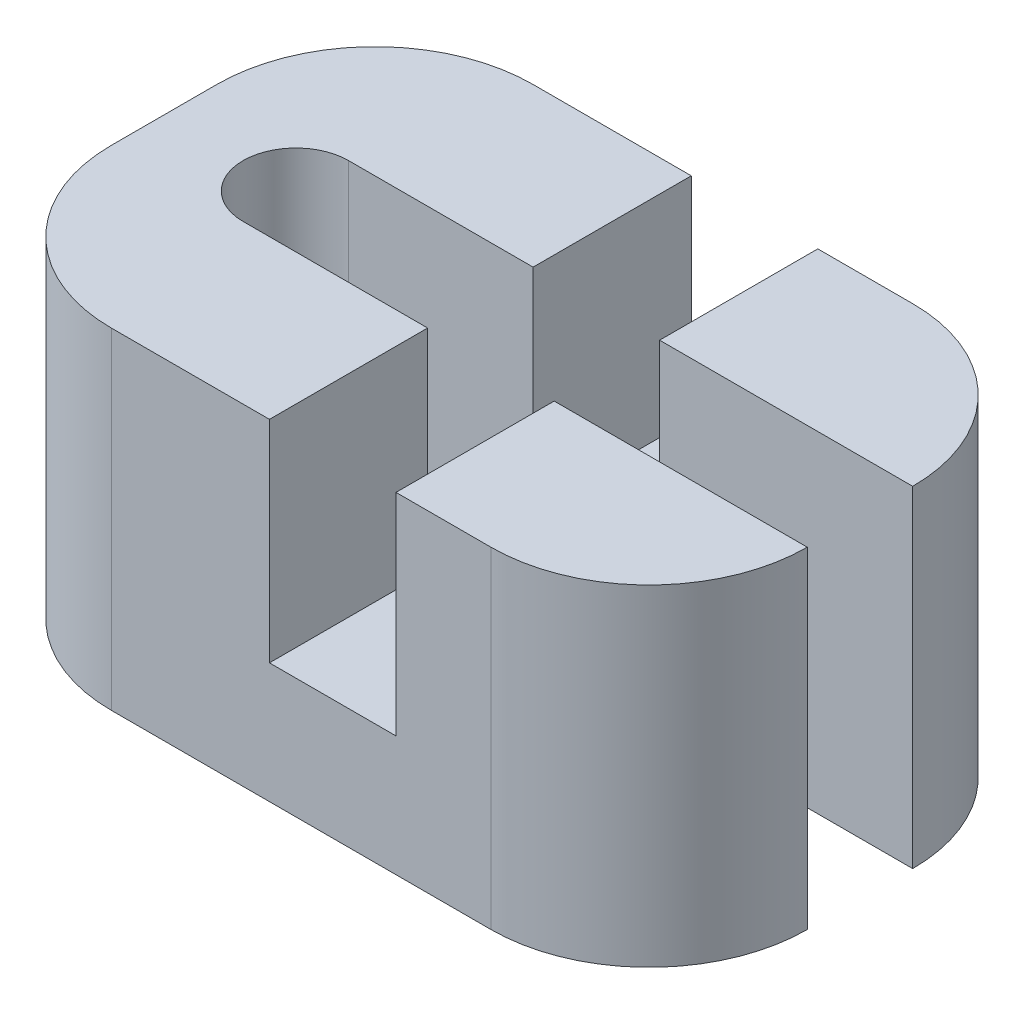
ISO-10303-21;
HEADER;
FILE_DESCRIPTION(('STEP AP214'),'2;1');
FILE_NAME('part.step','',(''),(''),'','','');
FILE_SCHEMA(('AUTOMOTIVE_DESIGN { 1 0 10303 214 1 1 1 1 }'));
ENDSEC;
DATA;
#1=APPLICATION_CONTEXT('core data for automotive mechanical design processes');
#2=APPLICATION_PROTOCOL_DEFINITION('international standard','automotive_design',2000,#1);
#3=PRODUCT_CONTEXT('',#1,'mechanical');
#4=PRODUCT('Part','Part','',(#3));
#5=PRODUCT_RELATED_PRODUCT_CATEGORY('part','',(#4));
#6=PRODUCT_DEFINITION_FORMATION('','',#4);
#7=PRODUCT_DEFINITION_CONTEXT('part definition',#1,'design');
#8=PRODUCT_DEFINITION('design','',#6,#7);
#9=PRODUCT_DEFINITION_SHAPE('','',#8);
#10=(LENGTH_UNIT() NAMED_UNIT(*) SI_UNIT(.MILLI.,.METRE.));
#11=(NAMED_UNIT(*) PLANE_ANGLE_UNIT() SI_UNIT($,.RADIAN.));
#12=(NAMED_UNIT(*) SI_UNIT($,.STERADIAN.) SOLID_ANGLE_UNIT());
#13=UNCERTAINTY_MEASURE_WITH_UNIT(LENGTH_MEASURE(1.E-05),#10,'distance_accuracy_value','');
#14=(GEOMETRIC_REPRESENTATION_CONTEXT(3) GLOBAL_UNCERTAINTY_ASSIGNED_CONTEXT((#13)) GLOBAL_UNIT_ASSIGNED_CONTEXT((#10,
#11,#12)) REPRESENTATION_CONTEXT('',''));
#15=CARTESIAN_POINT('',(0.,0.,0.));
#16=DIRECTION('',(0.,0.,1.));
#17=DIRECTION('',(1.,0.,0.));
#18=AXIS2_PLACEMENT_3D('',#15,#16,#17);
#19=CARTESIAN_POINT('',(0.,15.7,0.));
#20=DIRECTION('',(0.,-1.,0.));
#21=DIRECTION('',(0.,0.,-1.));
#22=AXIS2_PLACEMENT_3D('',#19,#20,#21);
#23=PLANE('',#22);
#24=DIRECTION('',(-1.,0.,0.));
#25=VECTOR('',#24,1.);
#26=CARTESIAN_POINT('',(-11.75,15.7,-2.5));
#27=LINE('',#26,#25);
#28=CARTESIAN_POINT('',(15.,15.7,-2.5));
#29=VERTEX_POINT('',#28);
#30=CARTESIAN_POINT('',(3.,15.7,-2.5));
#31=VERTEX_POINT('',#30);
#32=EDGE_CURVE('E203',#29,#31,#27,.T.);
#33=ORIENTED_EDGE('',*,*,#32,.F.);
#34=CARTESIAN_POINT('',(7.5,15.7,-2.49999999999998));
#35=DIRECTION('',(0.,-1.,0.));
#36=DIRECTION('',(0.,0.,-1.));
#37=AXIS2_PLACEMENT_3D('',#34,#35,#36);
#38=CIRCLE('',#37,7.5);
#39=CARTESIAN_POINT('',(7.5,15.7,-9.99999999999998));
#40=VERTEX_POINT('',#39);
#41=EDGE_CURVE('E42',#29,#40,#38,.F.);
#42=ORIENTED_EDGE('',*,*,#41,.T.);
#43=DIRECTION('',(-1.,0.,0.));
#44=VECTOR('',#43,1.);
#45=CARTESIAN_POINT('',(15.,15.7,-9.99999999999998));
#46=LINE('',#45,#44);
#47=CARTESIAN_POINT('',(3.,15.7,-9.99999999999998));
#48=VERTEX_POINT('',#47);
#49=EDGE_CURVE('E246',#40,#48,#46,.T.);
#50=ORIENTED_EDGE('',*,*,#49,.T.);
#51=DIRECTION('',(0.,0.,-1.));
#52=VECTOR('',#51,1.);
#53=CARTESIAN_POINT('',(3.,15.7,9.99999999999999));
#54=LINE('',#53,#52);
#55=EDGE_CURVE('E208',#31,#48,#54,.T.);
#56=ORIENTED_EDGE('',*,*,#55,.F.);
#57=EDGE_LOOP('',(#33,#42,#50,#56));
#58=FACE_BOUND('',#57,.T.);
#59=ADVANCED_FACE('F34',(#58),#23,.F.);
#60=CARTESIAN_POINT('',(3.,5.7,9.99999999999999));
#61=DIRECTION('',(1.,0.,0.));
#62=DIRECTION('',(0.,0.,-1.));
#63=AXIS2_PLACEMENT_3D('',#60,#61,#62);
#64=PLANE('',#63);
#65=CARTESIAN_POINT('',(3.,15.7,9.99999999999999));
#66=VERTEX_POINT('',#65);
#67=CARTESIAN_POINT('',(3.,15.7,2.5));
#68=VERTEX_POINT('',#67);
#69=EDGE_CURVE('E224',#66,#68,#54,.T.);
#70=ORIENTED_EDGE('',*,*,#69,.T.);
#71=DIRECTION('',(0.,1.,0.));
#72=VECTOR('',#71,1.);
#73=CARTESIAN_POINT('',(3.,-0.001000000000001,2.5));
#74=LINE('',#73,#72);
#75=CARTESIAN_POINT('',(3.,5.7,2.5));
#76=VERTEX_POINT('',#75);
#77=EDGE_CURVE('E174',#76,#68,#74,.T.);
#78=ORIENTED_EDGE('',*,*,#77,.F.);
#79=DIRECTION('',(0.,0.,-1.));
#80=VECTOR('',#79,1.);
#81=CARTESIAN_POINT('',(3.,5.7,9.99999999999999));
#82=LINE('',#81,#80);
#83=CARTESIAN_POINT('',(3.,5.7,9.99999999999999));
#84=VERTEX_POINT('',#83);
#85=EDGE_CURVE('E209',#84,#76,#82,.T.);
#86=ORIENTED_EDGE('',*,*,#85,.F.);
#87=DIRECTION('',(0.,1.,0.));
#88=VECTOR('',#87,1.);
#89=CARTESIAN_POINT('',(3.,5.7,9.99999999999999));
#90=LINE('',#89,#88);
#91=EDGE_CURVE('E230',#84,#66,#90,.T.);
#92=ORIENTED_EDGE('',*,*,#91,.T.);
#93=EDGE_LOOP('',(#70,#78,#86,#92));
#94=FACE_BOUND('',#93,.T.);
#95=ADVANCED_FACE('F326',(#94),#64,.F.);
#96=CARTESIAN_POINT('',(-3.,5.7,9.99999999999999));
#97=DIRECTION('',(-1.,0.,0.));
#98=DIRECTION('',(0.,0.,1.));
#99=AXIS2_PLACEMENT_3D('',#96,#97,#98);
#100=PLANE('',#99);
#101=DIRECTION('',(0.,0.,1.));
#102=VECTOR('',#101,1.);
#103=CARTESIAN_POINT('',(-3.,5.7,9.99999999999999));
#104=LINE('',#103,#102);
#105=CARTESIAN_POINT('',(-3.,5.7,2.5));
#106=VERTEX_POINT('',#105);
#107=CARTESIAN_POINT('',(-3.,5.7,9.99999999999999));
#108=VERTEX_POINT('',#107);
#109=EDGE_CURVE('E216',#106,#108,#104,.T.);
#110=ORIENTED_EDGE('',*,*,#109,.F.);
#111=DIRECTION('',(0.,-1.,0.));
#112=VECTOR('',#111,1.);
#113=CARTESIAN_POINT('',(-3.,-0.001000000000001,2.5));
#114=LINE('',#113,#112);
#115=CARTESIAN_POINT('',(-3.,15.7,2.5));
#116=VERTEX_POINT('',#115);
#117=EDGE_CURVE('E183',#116,#106,#114,.T.);
#118=ORIENTED_EDGE('',*,*,#117,.F.);
#119=DIRECTION('',(0.,0.,1.));
#120=VECTOR('',#119,1.);
#121=CARTESIAN_POINT('',(-3.,15.7,9.99999999999999));
#122=LINE('',#121,#120);
#123=CARTESIAN_POINT('',(-3.,15.7,9.99999999999999));
#124=VERTEX_POINT('',#123);
#125=EDGE_CURVE('E226',#116,#124,#122,.T.);
#126=ORIENTED_EDGE('',*,*,#125,.T.);
#127=DIRECTION('',(0.,1.,0.));
#128=VECTOR('',#127,1.);
#129=CARTESIAN_POINT('',(-3.,5.7,9.99999999999999));
#130=LINE('',#129,#128);
#131=EDGE_CURVE('E233',#108,#124,#130,.T.);
#132=ORIENTED_EDGE('',*,*,#131,.F.);
#133=EDGE_LOOP('',(#110,#118,#126,#132));
#134=FACE_BOUND('',#133,.T.);
#135=ADVANCED_FACE('F319',(#134),#100,.F.);
#136=CARTESIAN_POINT('',(0.,5.7,0.));
#137=DIRECTION('',(0.,-1.,0.));
#138=DIRECTION('',(0.,0.,-1.));
#139=AXIS2_PLACEMENT_3D('',#136,#137,#138);
#140=PLANE('',#139);
#141=ORIENTED_EDGE('',*,*,#85,.T.);
#142=DIRECTION('',(1.,0.,0.));
#143=VECTOR('',#142,1.);
#144=CARTESIAN_POINT('',(-11.75,5.7,2.5));
#145=LINE('',#144,#143);
#146=EDGE_CURVE('E204',#106,#76,#145,.T.);
#147=ORIENTED_EDGE('',*,*,#146,.F.);
#148=ORIENTED_EDGE('',*,*,#109,.T.);
#149=DIRECTION('',(1.,0.,0.));
#150=VECTOR('',#149,1.);
#151=CARTESIAN_POINT('',(-3.,5.7,9.99999999999999));
#152=LINE('',#151,#150);
#153=EDGE_CURVE('E220',#108,#84,#152,.T.);
#154=ORIENTED_EDGE('',*,*,#153,.T.);
#155=EDGE_LOOP('',(#141,#147,#148,#154));
#156=FACE_BOUND('',#155,.T.);
#157=ADVANCED_FACE('F323',(#156),#140,.F.);
#158=DIRECTION('',(1.,0.,0.));
#159=VECTOR('',#158,1.);
#160=CARTESIAN_POINT('',(15.,15.7,10.));
#161=LINE('',#160,#159);
#162=CARTESIAN_POINT('',(7.5,15.7,10.));
#163=VERTEX_POINT('',#162);
#164=EDGE_CURVE('E166',#66,#163,#161,.T.);
#165=ORIENTED_EDGE('',*,*,#164,.T.);
#166=CARTESIAN_POINT('',(7.5,15.7,2.50000000000002));
#167=DIRECTION('',(0.,-1.,0.));
#168=DIRECTION('',(0.,0.,-1.));
#169=AXIS2_PLACEMENT_3D('',#166,#167,#168);
#170=CIRCLE('',#169,7.5);
#171=CARTESIAN_POINT('',(15.,15.7,2.5));
#172=VERTEX_POINT('',#171);
#173=EDGE_CURVE('E11',#163,#172,#170,.F.);
#174=ORIENTED_EDGE('',*,*,#173,.T.);
#175=DIRECTION('',(1.,0.,0.));
#176=VECTOR('',#175,1.);
#177=CARTESIAN_POINT('',(-11.75,15.7,2.5));
#178=LINE('',#177,#176);
#179=EDGE_CURVE('E164',#68,#172,#178,.T.);
#180=ORIENTED_EDGE('',*,*,#179,.F.);
#181=ORIENTED_EDGE('',*,*,#69,.F.);
#182=EDGE_LOOP('',(#165,#174,#180,#181));
#183=FACE_BOUND('',#182,.T.);
#184=ADVANCED_FACE('F162',(#183),#23,.F.);
#185=CARTESIAN_POINT('',(15.,15.7,-9.99999999999998));
#186=DIRECTION('',(0.,0.,1.));
#187=DIRECTION('',(1.,0.,0.));
#188=AXIS2_PLACEMENT_3D('',#185,#186,#187);
#189=PLANE('',#188);
#190=DIRECTION('',(-1.,0.,0.));
#191=VECTOR('',#190,1.);
#192=CARTESIAN_POINT('',(15.,0.,-9.99999999999998));
#193=LINE('',#192,#191);
#194=CARTESIAN_POINT('',(7.5,0.,-9.99999999999998));
#195=VERTEX_POINT('',#194);
#196=CARTESIAN_POINT('',(-10.5,0.,-9.99999999999998));
#197=VERTEX_POINT('',#196);
#198=EDGE_CURVE('E243',#195,#197,#193,.T.);
#199=ORIENTED_EDGE('',*,*,#198,.T.);
#200=DIRECTION('',(0.,-1.,0.));
#201=VECTOR('',#200,1.);
#202=CARTESIAN_POINT('',(-10.5,15.7,-9.99999999999998));
#203=LINE('',#202,#201);
#204=CARTESIAN_POINT('',(-10.5,15.7,-9.99999999999998));
#205=VERTEX_POINT('',#204);
#206=EDGE_CURVE('E275',#197,#205,#203,.F.);
#207=ORIENTED_EDGE('',*,*,#206,.T.);
#208=CARTESIAN_POINT('',(-3.,15.7,-9.99999999999998));
#209=VERTEX_POINT('',#208);
#210=EDGE_CURVE('E249',#209,#205,#46,.T.);
#211=ORIENTED_EDGE('',*,*,#210,.F.);
#212=DIRECTION('',(0.,1.,0.));
#213=VECTOR('',#212,1.);
#214=CARTESIAN_POINT('',(-3.,5.7,-9.99999999999998));
#215=LINE('',#214,#213);
#216=CARTESIAN_POINT('',(-3.,5.7,-9.99999999999998));
#217=VERTEX_POINT('',#216);
#218=EDGE_CURVE('E236',#217,#209,#215,.T.);
#219=ORIENTED_EDGE('',*,*,#218,.F.);
#220=DIRECTION('',(-1.,0.,0.));
#221=VECTOR('',#220,1.);
#222=CARTESIAN_POINT('',(-3.,5.7,-9.99999999999998));
#223=LINE('',#222,#221);
#224=CARTESIAN_POINT('',(3.,5.7,-9.99999999999998));
#225=VERTEX_POINT('',#224);
#226=EDGE_CURVE('E212',#225,#217,#223,.T.);
#227=ORIENTED_EDGE('',*,*,#226,.F.);
#228=DIRECTION('',(0.,1.,0.));
#229=VECTOR('',#228,1.);
#230=CARTESIAN_POINT('',(3.,5.7,-9.99999999999998));
#231=LINE('',#230,#229);
#232=EDGE_CURVE('E223',#225,#48,#231,.T.);
#233=ORIENTED_EDGE('',*,*,#232,.T.);
#234=ORIENTED_EDGE('',*,*,#49,.F.);
#235=DIRECTION('',(0.,-1.,0.));
#236=VECTOR('',#235,1.);
#237=CARTESIAN_POINT('',(7.5,15.7,-9.99999999999998));
#238=LINE('',#237,#236);
#239=EDGE_CURVE('E272',#40,#195,#238,.T.);
#240=ORIENTED_EDGE('',*,*,#239,.T.);
#241=EDGE_LOOP('',(#199,#207,#211,#219,#227,#233,#234,#240));
#242=FACE_BOUND('',#241,.T.);
#243=ADVANCED_FACE('F292',(#242),#189,.F.);
#244=CARTESIAN_POINT('',(-18.,15.7,-9.99999999999998));
#245=DIRECTION('',(1.,0.,0.));
#246=DIRECTION('',(0.,0.,-1.));
#247=AXIS2_PLACEMENT_3D('',#244,#245,#246);
#248=PLANE('',#247);
#249=DIRECTION('',(0.,0.,1.));
#250=VECTOR('',#249,1.);
#251=CARTESIAN_POINT('',(-18.,15.7,-9.99999999999998));
#252=LINE('',#251,#250);
#253=CARTESIAN_POINT('',(-18.,15.7,-2.49999999999998));
#254=VERTEX_POINT('',#253);
#255=CARTESIAN_POINT('',(-18.,15.7,2.50000000000002));
#256=VERTEX_POINT('',#255);
#257=EDGE_CURVE('E248',#254,#256,#252,.T.);
#258=ORIENTED_EDGE('',*,*,#257,.F.);
#259=DIRECTION('',(0.,-1.,0.));
#260=VECTOR('',#259,1.);
#261=CARTESIAN_POINT('',(-18.,15.7,-2.49999999999998));
#262=LINE('',#261,#260);
#263=CARTESIAN_POINT('',(-18.,0.,-2.49999999999998));
#264=VERTEX_POINT('',#263);
#265=EDGE_CURVE('E262',#254,#264,#262,.T.);
#266=ORIENTED_EDGE('',*,*,#265,.T.);
#267=DIRECTION('',(0.,0.,1.));
#268=VECTOR('',#267,1.);
#269=CARTESIAN_POINT('',(-18.,0.,-9.99999999999998));
#270=LINE('',#269,#268);
#271=CARTESIAN_POINT('',(-18.,0.,2.50000000000002));
#272=VERTEX_POINT('',#271);
#273=EDGE_CURVE('E256',#264,#272,#270,.T.);
#274=ORIENTED_EDGE('',*,*,#273,.T.);
#275=DIRECTION('',(0.,-1.,0.));
#276=VECTOR('',#275,1.);
#277=CARTESIAN_POINT('',(-18.,15.7,2.50000000000002));
#278=LINE('',#277,#276);
#279=EDGE_CURVE('E253',#272,#256,#278,.F.);
#280=ORIENTED_EDGE('',*,*,#279,.T.);
#281=EDGE_LOOP('',(#258,#266,#274,#280));
#282=FACE_BOUND('',#281,.T.);
#283=ADVANCED_FACE('F335',(#282),#248,.F.);
#284=CARTESIAN_POINT('',(15.,15.7,10.));
#285=DIRECTION('',(0.,0.,-1.));
#286=DIRECTION('',(-1.,0.,0.));
#287=AXIS2_PLACEMENT_3D('',#284,#285,#286);
#288=PLANE('',#287);
#289=CARTESIAN_POINT('',(-10.5,15.7,10.));
#290=VERTEX_POINT('',#289);
#291=EDGE_CURVE('E251',#290,#124,#161,.T.);
#292=ORIENTED_EDGE('',*,*,#291,.F.);
#293=DIRECTION('',(0.,-1.,0.));
#294=VECTOR('',#293,1.);
#295=CARTESIAN_POINT('',(-10.5,15.7,10.));
#296=LINE('',#295,#294);
#297=CARTESIAN_POINT('',(-10.5,0.,10.));
#298=VERTEX_POINT('',#297);
#299=EDGE_CURVE('E281',#290,#298,#296,.T.);
#300=ORIENTED_EDGE('',*,*,#299,.T.);
#301=DIRECTION('',(1.,0.,0.));
#302=VECTOR('',#301,1.);
#303=CARTESIAN_POINT('',(15.,0.,10.));
#304=LINE('',#303,#302);
#305=CARTESIAN_POINT('',(7.5,0.,10.));
#306=VERTEX_POINT('',#305);
#307=EDGE_CURVE('E259',#298,#306,#304,.T.);
#308=ORIENTED_EDGE('',*,*,#307,.T.);
#309=DIRECTION('',(0.,-1.,0.));
#310=VECTOR('',#309,1.);
#311=CARTESIAN_POINT('',(7.5,15.7,10.));
#312=LINE('',#311,#310);
#313=EDGE_CURVE('E49',#306,#163,#312,.F.);
#314=ORIENTED_EDGE('',*,*,#313,.T.);
#315=ORIENTED_EDGE('',*,*,#164,.F.);
#316=ORIENTED_EDGE('',*,*,#91,.F.);
#317=ORIENTED_EDGE('',*,*,#153,.F.);
#318=ORIENTED_EDGE('',*,*,#131,.T.);
#319=EDGE_LOOP('',(#292,#300,#308,#314,#315,#316,#317,#318));
#320=FACE_BOUND('',#319,.T.);
#321=ADVANCED_FACE('F327',(#320),#288,.F.);
#322=ORIENTED_EDGE('',*,*,#210,.T.);
#323=CARTESIAN_POINT('',(-10.5,15.7,-2.49999999999998));
#324=DIRECTION('',(0.,-1.,0.));
#325=DIRECTION('',(0.,0.,-1.));
#326=AXIS2_PLACEMENT_3D('',#323,#324,#325);
#327=CIRCLE('',#326,7.5);
#328=EDGE_CURVE('E278',#205,#254,#327,.F.);
#329=ORIENTED_EDGE('',*,*,#328,.T.);
#330=ORIENTED_EDGE('',*,*,#257,.T.);
#331=CARTESIAN_POINT('',(-10.5,15.7,2.50000000000002));
#332=DIRECTION('',(0.,-1.,0.));
#333=DIRECTION('',(0.,0.,-1.));
#334=AXIS2_PLACEMENT_3D('',#331,#332,#333);
#335=CIRCLE('',#334,7.5);
#336=EDGE_CURVE('E57',#256,#290,#335,.F.);
#337=ORIENTED_EDGE('',*,*,#336,.T.);
#338=ORIENTED_EDGE('',*,*,#291,.T.);
#339=ORIENTED_EDGE('',*,*,#125,.F.);
#340=CARTESIAN_POINT('',(-11.75,15.7,2.5));
#341=VERTEX_POINT('',#340);
#342=EDGE_CURVE('E175',#341,#116,#178,.T.);
#343=ORIENTED_EDGE('',*,*,#342,.F.);
#344=CARTESIAN_POINT('',(-11.75,15.7,0.));
#345=DIRECTION('',(0.,1.,0.));
#346=DIRECTION('',(0.,0.,1.));
#347=AXIS2_PLACEMENT_3D('',#344,#345,#346);
#348=CIRCLE('',#347,2.5);
#349=CARTESIAN_POINT('',(-11.75,15.7,-2.5));
#350=VERTEX_POINT('',#349);
#351=EDGE_CURVE('E232',#350,#341,#348,.T.);
#352=ORIENTED_EDGE('',*,*,#351,.F.);
#353=CARTESIAN_POINT('',(-3.,15.7,-2.5));
#354=VERTEX_POINT('',#353);
#355=EDGE_CURVE('E201',#354,#350,#27,.T.);
#356=ORIENTED_EDGE('',*,*,#355,.F.);
#357=EDGE_CURVE('E227',#209,#354,#122,.T.);
#358=ORIENTED_EDGE('',*,*,#357,.F.);
#359=EDGE_LOOP('',(#322,#329,#330,#337,#338,#339,#343,#352,#356,#358));
#360=FACE_BOUND('',#359,.T.);
#361=ADVANCED_FACE('F311',(#360),#23,.F.);
#362=CARTESIAN_POINT('',(0.,0.,0.));
#363=DIRECTION('',(0.,-1.,0.));
#364=DIRECTION('',(0.,0.,-1.));
#365=AXIS2_PLACEMENT_3D('',#362,#363,#364);
#366=PLANE('',#365);
#367=ORIENTED_EDGE('',*,*,#273,.F.);
#368=CARTESIAN_POINT('',(-10.5,0.,-2.49999999999998));
#369=DIRECTION('',(0.,-1.,0.));
#370=DIRECTION('',(0.,0.,-1.));
#371=AXIS2_PLACEMENT_3D('',#368,#369,#370);
#372=CIRCLE('',#371,7.5);
#373=EDGE_CURVE('E270',#264,#197,#372,.T.);
#374=ORIENTED_EDGE('',*,*,#373,.T.);
#375=ORIENTED_EDGE('',*,*,#198,.F.);
#376=CARTESIAN_POINT('',(7.5,0.,-2.49999999999998));
#377=DIRECTION('',(0.,-1.,0.));
#378=DIRECTION('',(0.,0.,-1.));
#379=AXIS2_PLACEMENT_3D('',#376,#377,#378);
#380=CIRCLE('',#379,7.5);
#381=CARTESIAN_POINT('',(15.,0.,-2.5));
#382=VERTEX_POINT('',#381);
#383=EDGE_CURVE('E266',#195,#382,#380,.T.);
#384=ORIENTED_EDGE('',*,*,#383,.T.);
#385=DIRECTION('',(-1.,0.,0.));
#386=VECTOR('',#385,1.);
#387=CARTESIAN_POINT('',(-11.75,0.,-2.5));
#388=LINE('',#387,#386);
#389=CARTESIAN_POINT('',(-11.75,0.,-2.5));
#390=VERTEX_POINT('',#389);
#391=EDGE_CURVE('E176',#382,#390,#388,.T.);
#392=ORIENTED_EDGE('',*,*,#391,.T.);
#393=CARTESIAN_POINT('',(-11.75,0.,0.));
#394=DIRECTION('',(0.,-1.,0.));
#395=DIRECTION('',(0.,0.,-1.));
#396=AXIS2_PLACEMENT_3D('',#393,#394,#395);
#397=CIRCLE('',#396,2.5);
#398=CARTESIAN_POINT('',(-11.75,0.,2.5));
#399=VERTEX_POINT('',#398);
#400=EDGE_CURVE('E240',#390,#399,#397,.F.);
#401=ORIENTED_EDGE('',*,*,#400,.T.);
#402=DIRECTION('',(1.,0.,0.));
#403=VECTOR('',#402,1.);
#404=CARTESIAN_POINT('',(-11.75,0.,2.5));
#405=LINE('',#404,#403);
#406=CARTESIAN_POINT('',(15.,0.,2.5));
#407=VERTEX_POINT('',#406);
#408=EDGE_CURVE('E206',#399,#407,#405,.T.);
#409=ORIENTED_EDGE('',*,*,#408,.T.);
#410=CARTESIAN_POINT('',(7.5,0.,2.50000000000002));
#411=DIRECTION('',(0.,-1.,0.));
#412=DIRECTION('',(0.,0.,-1.));
#413=AXIS2_PLACEMENT_3D('',#410,#411,#412);
#414=CIRCLE('',#413,7.5);
#415=EDGE_CURVE('E178',#407,#306,#414,.T.);
#416=ORIENTED_EDGE('',*,*,#415,.T.);
#417=ORIENTED_EDGE('',*,*,#307,.F.);
#418=CARTESIAN_POINT('',(-10.5,0.,2.50000000000002));
#419=DIRECTION('',(0.,-1.,0.));
#420=DIRECTION('',(0.,0.,-1.));
#421=AXIS2_PLACEMENT_3D('',#418,#419,#420);
#422=CIRCLE('',#421,7.5);
#423=EDGE_CURVE('E268',#298,#272,#422,.T.);
#424=ORIENTED_EDGE('',*,*,#423,.T.);
#425=EDGE_LOOP('',(#367,#374,#375,#384,#392,#401,#409,#416,#417,#424));
#426=FACE_BOUND('',#425,.T.);
#427=ADVANCED_FACE('F300',(#426),#366,.T.);
#428=CARTESIAN_POINT('',(-11.75,-0.001000000000001,0.));
#429=DIRECTION('',(0.,1.,0.));
#430=DIRECTION('',(0.,0.,1.));
#431=AXIS2_PLACEMENT_3D('',#428,#429,#430);
#432=CYLINDRICAL_SURFACE('',#431,2.5);
#433=ORIENTED_EDGE('',*,*,#351,.T.);
#434=DIRECTION('',(0.,1.,0.));
#435=VECTOR('',#434,1.);
#436=CARTESIAN_POINT('',(-11.75,-0.001000000000001,2.5));
#437=LINE('',#436,#435);
#438=EDGE_CURVE('E192',#399,#341,#437,.T.);
#439=ORIENTED_EDGE('',*,*,#438,.F.);
#440=ORIENTED_EDGE('',*,*,#400,.F.);
#441=DIRECTION('',(0.,1.,0.));
#442=VECTOR('',#441,1.);
#443=CARTESIAN_POINT('',(-11.75,-0.001000000000001,-2.5));
#444=LINE('',#443,#442);
#445=EDGE_CURVE('E194',#390,#350,#444,.T.);
#446=ORIENTED_EDGE('',*,*,#445,.T.);
#447=EDGE_LOOP('',(#433,#439,#440,#446));
#448=FACE_BOUND('',#447,.T.);
#449=ADVANCED_FACE('F307',(#448),#432,.F.);
#450=CARTESIAN_POINT('',(3.,5.7,-2.5));
#451=VERTEX_POINT('',#450);
#452=EDGE_CURVE('E213',#451,#225,#82,.T.);
#453=ORIENTED_EDGE('',*,*,#452,.F.);
#454=DIRECTION('',(0.,-1.,0.));
#455=VECTOR('',#454,1.);
#456=CARTESIAN_POINT('',(3.,-0.001000000000001,-2.5));
#457=LINE('',#456,#455);
#458=EDGE_CURVE('E190',#31,#451,#457,.T.);
#459=ORIENTED_EDGE('',*,*,#458,.F.);
#460=ORIENTED_EDGE('',*,*,#55,.T.);
#461=ORIENTED_EDGE('',*,*,#232,.F.);
#462=EDGE_LOOP('',(#453,#459,#460,#461));
#463=FACE_BOUND('',#462,.T.);
#464=ADVANCED_FACE('F352',(#463),#64,.F.);
#465=ORIENTED_EDGE('',*,*,#357,.T.);
#466=DIRECTION('',(0.,1.,0.));
#467=VECTOR('',#466,1.);
#468=CARTESIAN_POINT('',(-3.,-0.001000000000001,-2.5));
#469=LINE('',#468,#467);
#470=CARTESIAN_POINT('',(-3.,5.7,-2.5));
#471=VERTEX_POINT('',#470);
#472=EDGE_CURVE('E187',#471,#354,#469,.T.);
#473=ORIENTED_EDGE('',*,*,#472,.F.);
#474=EDGE_CURVE('E217',#217,#471,#104,.T.);
#475=ORIENTED_EDGE('',*,*,#474,.F.);
#476=ORIENTED_EDGE('',*,*,#218,.T.);
#477=EDGE_LOOP('',(#465,#473,#475,#476));
#478=FACE_BOUND('',#477,.T.);
#479=ADVANCED_FACE('F345',(#478),#100,.F.);
#480=ORIENTED_EDGE('',*,*,#474,.T.);
#481=DIRECTION('',(-1.,0.,0.));
#482=VECTOR('',#481,1.);
#483=CARTESIAN_POINT('',(-11.75,5.7,-2.5));
#484=LINE('',#483,#482);
#485=EDGE_CURVE('E197',#451,#471,#484,.T.);
#486=ORIENTED_EDGE('',*,*,#485,.F.);
#487=ORIENTED_EDGE('',*,*,#452,.T.);
#488=ORIENTED_EDGE('',*,*,#226,.T.);
#489=EDGE_LOOP('',(#480,#486,#487,#488));
#490=FACE_BOUND('',#489,.T.);
#491=ADVANCED_FACE('F347',(#490),#140,.F.);
#492=CARTESIAN_POINT('',(-11.75,-0.001000000000001,-2.5));
#493=DIRECTION('',(0.,0.,-1.));
#494=DIRECTION('',(-1.,0.,0.));
#495=AXIS2_PLACEMENT_3D('',#492,#493,#494);
#496=PLANE('',#495);
#497=ORIENTED_EDGE('',*,*,#391,.F.);
#498=DIRECTION('',(0.,1.,0.));
#499=VECTOR('',#498,1.);
#500=CARTESIAN_POINT('',(15.,-0.001000000000001,-2.5));
#501=LINE('',#500,#499);
#502=EDGE_CURVE('E180',#382,#29,#501,.T.);
#503=ORIENTED_EDGE('',*,*,#502,.T.);
#504=ORIENTED_EDGE('',*,*,#32,.T.);
#505=ORIENTED_EDGE('',*,*,#458,.T.);
#506=ORIENTED_EDGE('',*,*,#485,.T.);
#507=ORIENTED_EDGE('',*,*,#472,.T.);
#508=ORIENTED_EDGE('',*,*,#355,.T.);
#509=ORIENTED_EDGE('',*,*,#445,.F.);
#510=EDGE_LOOP('',(#497,#503,#504,#505,#506,#507,#508,#509));
#511=FACE_BOUND('',#510,.T.);
#512=ADVANCED_FACE('F303',(#511),#496,.F.);
#513=CARTESIAN_POINT('',(-11.75,-0.001000000000001,2.5));
#514=DIRECTION('',(0.,0.,1.));
#515=DIRECTION('',(1.,0.,0.));
#516=AXIS2_PLACEMENT_3D('',#513,#514,#515);
#517=PLANE('',#516);
#518=ORIENTED_EDGE('',*,*,#438,.T.);
#519=ORIENTED_EDGE('',*,*,#342,.T.);
#520=ORIENTED_EDGE('',*,*,#117,.T.);
#521=ORIENTED_EDGE('',*,*,#146,.T.);
#522=ORIENTED_EDGE('',*,*,#77,.T.);
#523=ORIENTED_EDGE('',*,*,#179,.T.);
#524=DIRECTION('',(0.,1.,0.));
#525=VECTOR('',#524,1.);
#526=CARTESIAN_POINT('',(15.,-0.001000000000001,2.5));
#527=LINE('',#526,#525);
#528=EDGE_CURVE('E172',#407,#172,#527,.T.);
#529=ORIENTED_EDGE('',*,*,#528,.F.);
#530=ORIENTED_EDGE('',*,*,#408,.F.);
#531=EDGE_LOOP('',(#518,#519,#520,#521,#522,#523,#529,#530));
#532=FACE_BOUND('',#531,.T.);
#533=ADVANCED_FACE('F171',(#532),#517,.F.);
#534=CARTESIAN_POINT('',(-10.5,15.7,-2.49999999999998));
#535=DIRECTION('',(0.,-1.,0.));
#536=DIRECTION('',(0.,0.,-1.));
#537=AXIS2_PLACEMENT_3D('',#534,#535,#536);
#538=CYLINDRICAL_SURFACE('',#537,7.5);
#539=ORIENTED_EDGE('',*,*,#328,.F.);
#540=ORIENTED_EDGE('',*,*,#206,.F.);
#541=ORIENTED_EDGE('',*,*,#373,.F.);
#542=ORIENTED_EDGE('',*,*,#265,.F.);
#543=EDGE_LOOP('',(#539,#540,#541,#542));
#544=FACE_BOUND('',#543,.T.);
#545=ADVANCED_FACE('F339',(#544),#538,.T.);
#546=CARTESIAN_POINT('',(-10.5,15.7,2.50000000000002));
#547=DIRECTION('',(0.,-1.,0.));
#548=DIRECTION('',(0.,0.,-1.));
#549=AXIS2_PLACEMENT_3D('',#546,#547,#548);
#550=CYLINDRICAL_SURFACE('',#549,7.5);
#551=ORIENTED_EDGE('',*,*,#336,.F.);
#552=ORIENTED_EDGE('',*,*,#279,.F.);
#553=ORIENTED_EDGE('',*,*,#423,.F.);
#554=ORIENTED_EDGE('',*,*,#299,.F.);
#555=EDGE_LOOP('',(#551,#552,#553,#554));
#556=FACE_BOUND('',#555,.T.);
#557=ADVANCED_FACE('F331',(#556),#550,.T.);
#558=CARTESIAN_POINT('',(7.5,15.7,-2.49999999999998));
#559=DIRECTION('',(0.,-1.,0.));
#560=DIRECTION('',(0.,0.,-1.));
#561=AXIS2_PLACEMENT_3D('',#558,#559,#560);
#562=CYLINDRICAL_SURFACE('',#561,7.5);
#563=ORIENTED_EDGE('',*,*,#41,.F.);
#564=ORIENTED_EDGE('',*,*,#502,.F.);
#565=ORIENTED_EDGE('',*,*,#383,.F.);
#566=ORIENTED_EDGE('',*,*,#239,.F.);
#567=EDGE_LOOP('',(#563,#564,#565,#566));
#568=FACE_BOUND('',#567,.T.);
#569=ADVANCED_FACE('F296',(#568),#562,.T.);
#570=CARTESIAN_POINT('',(7.5,15.7,2.50000000000002));
#571=DIRECTION('',(0.,-1.,0.));
#572=DIRECTION('',(0.,0.,-1.));
#573=AXIS2_PLACEMENT_3D('',#570,#571,#572);
#574=CYLINDRICAL_SURFACE('',#573,7.5);
#575=ORIENTED_EDGE('',*,*,#173,.F.);
#576=ORIENTED_EDGE('',*,*,#313,.F.);
#577=ORIENTED_EDGE('',*,*,#415,.F.);
#578=ORIENTED_EDGE('',*,*,#528,.T.);
#579=EDGE_LOOP('',(#575,#576,#577,#578));
#580=FACE_BOUND('',#579,.T.);
#581=ADVANCED_FACE('F36',(#580),#574,.T.);
#582=CLOSED_SHELL('',(#59,#95,#135,#157,#184,#243,#283,#321,#361,#427,#449,#464,#479,#491,#512,
#533,#545,#557,#569,#581));
#583=MANIFOLD_SOLID_BREP('B2',#582);
#584=ADVANCED_BREP_SHAPE_REPRESENTATION('',(#18,#583),#14);
#585=SHAPE_DEFINITION_REPRESENTATION(#9,#584);
ENDSEC;
END-ISO-10303-21;
